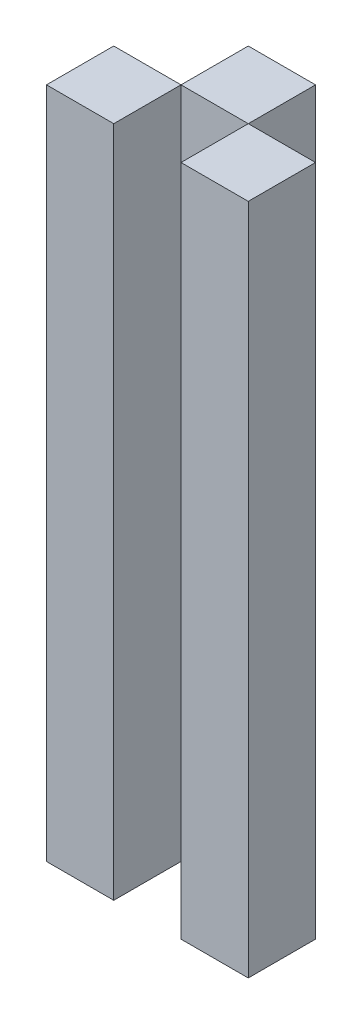
ISO-10303-21;
HEADER;
FILE_DESCRIPTION(('STEP AP214'),'2;1');
FILE_NAME('part.step','',(''),(''),'','','');
FILE_SCHEMA(('AUTOMOTIVE_DESIGN { 1 0 10303 214 1 1 1 1 }'));
ENDSEC;
DATA;
#1=APPLICATION_CONTEXT('core data for automotive mechanical design processes');
#2=APPLICATION_PROTOCOL_DEFINITION('international standard','automotive_design',2000,#1);
#3=PRODUCT_CONTEXT('',#1,'mechanical');
#4=PRODUCT('Part','Part','',(#3));
#5=PRODUCT_RELATED_PRODUCT_CATEGORY('part','',(#4));
#6=PRODUCT_DEFINITION_FORMATION('','',#4);
#7=PRODUCT_DEFINITION_CONTEXT('part definition',#1,'design');
#8=PRODUCT_DEFINITION('design','',#6,#7);
#9=PRODUCT_DEFINITION_SHAPE('','',#8);
#10=(LENGTH_UNIT() NAMED_UNIT(*) SI_UNIT(.MILLI.,.METRE.));
#11=(NAMED_UNIT(*) PLANE_ANGLE_UNIT() SI_UNIT($,.RADIAN.));
#12=(NAMED_UNIT(*) SI_UNIT($,.STERADIAN.) SOLID_ANGLE_UNIT());
#13=UNCERTAINTY_MEASURE_WITH_UNIT(LENGTH_MEASURE(1.E-05),#10,'distance_accuracy_value','');
#14=(GEOMETRIC_REPRESENTATION_CONTEXT(3) GLOBAL_UNCERTAINTY_ASSIGNED_CONTEXT((#13)) GLOBAL_UNIT_ASSIGNED_CONTEXT((#10,
#11,#12)) REPRESENTATION_CONTEXT('',''));
#15=CARTESIAN_POINT('',(0.,0.,0.));
#16=DIRECTION('',(0.,0.,1.));
#17=DIRECTION('',(1.,0.,0.));
#18=AXIS2_PLACEMENT_3D('',#15,#16,#17);
#19=CARTESIAN_POINT('',(25.4047173550075,254.,-25.4));
#20=DIRECTION('',(1.,0.,0.));
#21=DIRECTION('',(0.,1.,0.));
#22=AXIS2_PLACEMENT_3D('',#19,#20,#21);
#23=PLANE('',#22);
#24=DIRECTION('',(0.,1.,0.));
#25=VECTOR('',#24,1.);
#26=CARTESIAN_POINT('',(25.4047173550075,254.,0.));
#27=LINE('',#26,#25);
#28=CARTESIAN_POINT('',(25.4047173550075,0.,0.));
#29=VERTEX_POINT('',#28);
#30=CARTESIAN_POINT('',(25.4047173550075,254.,0.));
#31=VERTEX_POINT('',#30);
#32=EDGE_CURVE('E113',#29,#31,#27,.T.);
#33=ORIENTED_EDGE('',*,*,#32,.T.);
#34=DIRECTION('',(0.,0.,1.));
#35=VECTOR('',#34,1.);
#36=CARTESIAN_POINT('',(25.4047173550075,254.,-25.4));
#37=LINE('',#36,#35);
#38=CARTESIAN_POINT('',(25.4047173550075,254.,-25.4));
#39=VERTEX_POINT('',#38);
#40=EDGE_CURVE('E12',#39,#31,#37,.T.);
#41=ORIENTED_EDGE('',*,*,#40,.F.);
#42=DIRECTION('',(0.,1.,0.));
#43=VECTOR('',#42,1.);
#44=CARTESIAN_POINT('',(25.4047173550075,254.,-25.4));
#45=LINE('',#44,#43);
#46=CARTESIAN_POINT('',(25.4047173550075,0.,-25.4));
#47=VERTEX_POINT('',#46);
#48=EDGE_CURVE('E101',#47,#39,#45,.T.);
#49=ORIENTED_EDGE('',*,*,#48,.F.);
#50=DIRECTION('',(0.,0.,1.));
#51=VECTOR('',#50,1.);
#52=CARTESIAN_POINT('',(25.4047173550075,0.,-25.4));
#53=LINE('',#52,#51);
#54=EDGE_CURVE('E109',#47,#29,#53,.T.);
#55=ORIENTED_EDGE('',*,*,#54,.T.);
#56=EDGE_LOOP('',(#33,#41,#49,#55));
#57=FACE_BOUND('',#56,.T.);
#58=ADVANCED_FACE('F50',(#57),#23,.F.);
#59=CARTESIAN_POINT('',(50.8047173550075,254.,-25.4));
#60=DIRECTION('',(0.,-1.,0.));
#61=DIRECTION('',(0.,0.,-1.));
#62=AXIS2_PLACEMENT_3D('',#59,#60,#61);
#63=PLANE('',#62);
#64=DIRECTION('',(1.,0.,0.));
#65=VECTOR('',#64,1.);
#66=CARTESIAN_POINT('',(50.8047173550075,254.,0.));
#67=LINE('',#66,#65);
#68=CARTESIAN_POINT('',(50.8047173550075,254.,0.));
#69=VERTEX_POINT('',#68);
#70=EDGE_CURVE('E105',#31,#69,#67,.T.);
#71=ORIENTED_EDGE('',*,*,#70,.T.);
#72=DIRECTION('',(0.,0.,1.));
#73=VECTOR('',#72,1.);
#74=CARTESIAN_POINT('',(50.8047173550075,254.,-25.4));
#75=LINE('',#74,#73);
#76=CARTESIAN_POINT('',(50.8047173550075,254.,-25.4));
#77=VERTEX_POINT('',#76);
#78=EDGE_CURVE('E58',#77,#69,#75,.T.);
#79=ORIENTED_EDGE('',*,*,#78,.F.);
#80=DIRECTION('',(1.,0.,0.));
#81=VECTOR('',#80,1.);
#82=CARTESIAN_POINT('',(50.8047173550075,254.,-25.4));
#83=LINE('',#82,#81);
#84=EDGE_CURVE('E96',#39,#77,#83,.T.);
#85=ORIENTED_EDGE('',*,*,#84,.F.);
#86=ORIENTED_EDGE('',*,*,#40,.T.);
#87=EDGE_LOOP('',(#71,#79,#85,#86));
#88=FACE_BOUND('',#87,.T.);
#89=ADVANCED_FACE('F104',(#88),#63,.F.);
#90=CARTESIAN_POINT('',(50.8047173550075,0.,-25.4));
#91=DIRECTION('',(-1.,0.,0.));
#92=DIRECTION('',(0.,0.,1.));
#93=AXIS2_PLACEMENT_3D('',#90,#91,#92);
#94=PLANE('',#93);
#95=DIRECTION('',(0.,-1.,0.));
#96=VECTOR('',#95,1.);
#97=CARTESIAN_POINT('',(50.8047173550075,0.,0.));
#98=LINE('',#97,#96);
#99=CARTESIAN_POINT('',(50.8047173550075,0.,0.));
#100=VERTEX_POINT('',#99);
#101=EDGE_CURVE('E83',#69,#100,#98,.T.);
#102=ORIENTED_EDGE('',*,*,#101,.T.);
#103=DIRECTION('',(0.,0.,1.));
#104=VECTOR('',#103,1.);
#105=CARTESIAN_POINT('',(50.8047173550075,0.,-25.4));
#106=LINE('',#105,#104);
#107=CARTESIAN_POINT('',(50.8047173550075,0.,-25.4));
#108=VERTEX_POINT('',#107);
#109=EDGE_CURVE('E106',#108,#100,#106,.T.);
#110=ORIENTED_EDGE('',*,*,#109,.F.);
#111=DIRECTION('',(0.,-1.,0.));
#112=VECTOR('',#111,1.);
#113=CARTESIAN_POINT('',(50.8047173550075,0.,-25.4));
#114=LINE('',#113,#112);
#115=EDGE_CURVE('E99',#77,#108,#114,.T.);
#116=ORIENTED_EDGE('',*,*,#115,.F.);
#117=ORIENTED_EDGE('',*,*,#78,.T.);
#118=EDGE_LOOP('',(#102,#110,#116,#117));
#119=FACE_BOUND('',#118,.T.);
#120=ADVANCED_FACE('F107',(#119),#94,.F.);
#121=CARTESIAN_POINT('',(25.4047173550075,0.,-25.4));
#122=DIRECTION('',(0.,1.,0.));
#123=DIRECTION('',(0.,0.,1.));
#124=AXIS2_PLACEMENT_3D('',#121,#122,#123);
#125=PLANE('',#124);
#126=DIRECTION('',(-1.,0.,0.));
#127=VECTOR('',#126,1.);
#128=CARTESIAN_POINT('',(25.4047173550075,0.,0.));
#129=LINE('',#128,#127);
#130=EDGE_CURVE('E89',#100,#29,#129,.T.);
#131=ORIENTED_EDGE('',*,*,#130,.T.);
#132=ORIENTED_EDGE('',*,*,#54,.F.);
#133=DIRECTION('',(-1.,0.,0.));
#134=VECTOR('',#133,1.);
#135=CARTESIAN_POINT('',(25.4047173550075,0.,-25.4));
#136=LINE('',#135,#134);
#137=EDGE_CURVE('E66',#108,#47,#136,.T.);
#138=ORIENTED_EDGE('',*,*,#137,.F.);
#139=ORIENTED_EDGE('',*,*,#109,.T.);
#140=EDGE_LOOP('',(#131,#132,#138,#139));
#141=FACE_BOUND('',#140,.T.);
#142=ADVANCED_FACE('F120',(#141),#125,.F.);
#143=CARTESIAN_POINT('',(0.,0.,-25.4));
#144=DIRECTION('',(0.,0.,1.));
#145=DIRECTION('',(1.,0.,0.));
#146=AXIS2_PLACEMENT_3D('',#143,#144,#145);
#147=PLANE('',#146);
#148=ORIENTED_EDGE('',*,*,#48,.T.);
#149=ORIENTED_EDGE('',*,*,#84,.T.);
#150=ORIENTED_EDGE('',*,*,#115,.T.);
#151=ORIENTED_EDGE('',*,*,#137,.T.);
#152=EDGE_LOOP('',(#148,#149,#150,#151));
#153=FACE_BOUND('',#152,.T.);
#154=ADVANCED_FACE('F97',(#153),#147,.F.);
#155=CARTESIAN_POINT('',(0.,0.,0.));
#156=DIRECTION('',(0.,0.,1.));
#157=DIRECTION('',(1.,0.,0.));
#158=AXIS2_PLACEMENT_3D('',#155,#156,#157);
#159=PLANE('',#158);
#160=ORIENTED_EDGE('',*,*,#32,.F.);
#161=ORIENTED_EDGE('',*,*,#130,.F.);
#162=ORIENTED_EDGE('',*,*,#101,.F.);
#163=ORIENTED_EDGE('',*,*,#70,.F.);
#164=EDGE_LOOP('',(#160,#161,#162,#163));
#165=FACE_BOUND('',#164,.T.);
#166=ADVANCED_FACE('F123',(#165),#159,.T.);
#167=CLOSED_SHELL('',(#58,#89,#120,#142,#154,#166));
#168=MANIFOLD_SOLID_BREP('B2',#167);
#169=CARTESIAN_POINT('',(0.,254.,25.4));
#170=DIRECTION('',(0.,-1.,0.));
#171=DIRECTION('',(0.,0.,-1.));
#172=AXIS2_PLACEMENT_3D('',#169,#170,#171);
#173=PLANE('',#172);
#174=DIRECTION('',(-1.,0.,0.));
#175=VECTOR('',#174,1.);
#176=CARTESIAN_POINT('',(0.,254.,0.));
#177=LINE('',#176,#175);
#178=CARTESIAN_POINT('',(25.4047173550075,254.,0.));
#179=VERTEX_POINT('',#178);
#180=CARTESIAN_POINT('',(0.,254.,0.));
#181=VERTEX_POINT('',#180);
#182=EDGE_CURVE('E246',#179,#181,#177,.T.);
#183=ORIENTED_EDGE('',*,*,#182,.T.);
#184=DIRECTION('',(0.,0.,-1.));
#185=VECTOR('',#184,1.);
#186=CARTESIAN_POINT('',(0.,254.,25.4));
#187=LINE('',#186,#185);
#188=CARTESIAN_POINT('',(0.,254.,25.4));
#189=VERTEX_POINT('',#188);
#190=EDGE_CURVE('E48',#189,#181,#187,.T.);
#191=ORIENTED_EDGE('',*,*,#190,.F.);
#192=DIRECTION('',(-1.,0.,0.));
#193=VECTOR('',#192,1.);
#194=CARTESIAN_POINT('',(0.,254.,25.4));
#195=LINE('',#194,#193);
#196=CARTESIAN_POINT('',(25.4047173550075,254.,25.4));
#197=VERTEX_POINT('',#196);
#198=EDGE_CURVE('E234',#197,#189,#195,.T.);
#199=ORIENTED_EDGE('',*,*,#198,.F.);
#200=DIRECTION('',(0.,0.,-1.));
#201=VECTOR('',#200,1.);
#202=CARTESIAN_POINT('',(25.4047173550075,254.,25.4));
#203=LINE('',#202,#201);
#204=EDGE_CURVE('E242',#197,#179,#203,.T.);
#205=ORIENTED_EDGE('',*,*,#204,.T.);
#206=EDGE_LOOP('',(#183,#191,#199,#205));
#207=FACE_BOUND('',#206,.T.);
#208=ADVANCED_FACE('F183',(#207),#173,.F.);
#209=CARTESIAN_POINT('',(0.,0.,25.4));
#210=DIRECTION('',(1.,0.,0.));
#211=DIRECTION('',(0.,0.,-1.));
#212=AXIS2_PLACEMENT_3D('',#209,#210,#211);
#213=PLANE('',#212);
#214=DIRECTION('',(0.,-1.,0.));
#215=VECTOR('',#214,1.);
#216=CARTESIAN_POINT('',(0.,0.,0.));
#217=LINE('',#216,#215);
#218=CARTESIAN_POINT('',(0.,0.,0.));
#219=VERTEX_POINT('',#218);
#220=EDGE_CURVE('E238',#181,#219,#217,.T.);
#221=ORIENTED_EDGE('',*,*,#220,.T.);
#222=DIRECTION('',(0.,0.,-1.));
#223=VECTOR('',#222,1.);
#224=CARTESIAN_POINT('',(0.,0.,25.4));
#225=LINE('',#224,#223);
#226=CARTESIAN_POINT('',(0.,0.,25.4));
#227=VERTEX_POINT('',#226);
#228=EDGE_CURVE('E191',#227,#219,#225,.T.);
#229=ORIENTED_EDGE('',*,*,#228,.F.);
#230=DIRECTION('',(0.,-1.,0.));
#231=VECTOR('',#230,1.);
#232=CARTESIAN_POINT('',(0.,0.,25.4));
#233=LINE('',#232,#231);
#234=EDGE_CURVE('E229',#189,#227,#233,.T.);
#235=ORIENTED_EDGE('',*,*,#234,.F.);
#236=ORIENTED_EDGE('',*,*,#190,.T.);
#237=EDGE_LOOP('',(#221,#229,#235,#236));
#238=FACE_BOUND('',#237,.T.);
#239=ADVANCED_FACE('F237',(#238),#213,.F.);
#240=CARTESIAN_POINT('',(0.,0.,25.4));
#241=DIRECTION('',(0.,1.,0.));
#242=DIRECTION('',(0.,0.,1.));
#243=AXIS2_PLACEMENT_3D('',#240,#241,#242);
#244=PLANE('',#243);
#245=DIRECTION('',(1.,0.,0.));
#246=VECTOR('',#245,1.);
#247=CARTESIAN_POINT('',(0.,0.,0.));
#248=LINE('',#247,#246);
#249=CARTESIAN_POINT('',(25.4047173550075,0.,0.));
#250=VERTEX_POINT('',#249);
#251=EDGE_CURVE('E216',#219,#250,#248,.T.);
#252=ORIENTED_EDGE('',*,*,#251,.T.);
#253=DIRECTION('',(0.,0.,-1.));
#254=VECTOR('',#253,1.);
#255=CARTESIAN_POINT('',(25.4047173550075,0.,25.4));
#256=LINE('',#255,#254);
#257=CARTESIAN_POINT('',(25.4047173550075,0.,25.4));
#258=VERTEX_POINT('',#257);
#259=EDGE_CURVE('E239',#258,#250,#256,.T.);
#260=ORIENTED_EDGE('',*,*,#259,.F.);
#261=DIRECTION('',(1.,0.,0.));
#262=VECTOR('',#261,1.);
#263=CARTESIAN_POINT('',(0.,0.,25.4));
#264=LINE('',#263,#262);
#265=EDGE_CURVE('E232',#227,#258,#264,.T.);
#266=ORIENTED_EDGE('',*,*,#265,.F.);
#267=ORIENTED_EDGE('',*,*,#228,.T.);
#268=EDGE_LOOP('',(#252,#260,#266,#267));
#269=FACE_BOUND('',#268,.T.);
#270=ADVANCED_FACE('F240',(#269),#244,.F.);
#271=CARTESIAN_POINT('',(25.4047173550075,0.,25.4));
#272=DIRECTION('',(-1.,0.,0.));
#273=DIRECTION('',(0.,0.,1.));
#274=AXIS2_PLACEMENT_3D('',#271,#272,#273);
#275=PLANE('',#274);
#276=DIRECTION('',(0.,1.,0.));
#277=VECTOR('',#276,1.);
#278=CARTESIAN_POINT('',(25.4047173550075,0.,0.));
#279=LINE('',#278,#277);
#280=EDGE_CURVE('E222',#250,#179,#279,.T.);
#281=ORIENTED_EDGE('',*,*,#280,.T.);
#282=ORIENTED_EDGE('',*,*,#204,.F.);
#283=DIRECTION('',(0.,1.,0.));
#284=VECTOR('',#283,1.);
#285=CARTESIAN_POINT('',(25.4047173550075,0.,25.4));
#286=LINE('',#285,#284);
#287=EDGE_CURVE('E199',#258,#197,#286,.T.);
#288=ORIENTED_EDGE('',*,*,#287,.F.);
#289=ORIENTED_EDGE('',*,*,#259,.T.);
#290=EDGE_LOOP('',(#281,#282,#288,#289));
#291=FACE_BOUND('',#290,.T.);
#292=ADVANCED_FACE('F253',(#291),#275,.F.);
#293=CARTESIAN_POINT('',(0.,0.,25.4));
#294=DIRECTION('',(0.,0.,1.));
#295=DIRECTION('',(1.,0.,0.));
#296=AXIS2_PLACEMENT_3D('',#293,#294,#295);
#297=PLANE('',#296);
#298=ORIENTED_EDGE('',*,*,#198,.T.);
#299=ORIENTED_EDGE('',*,*,#234,.T.);
#300=ORIENTED_EDGE('',*,*,#265,.T.);
#301=ORIENTED_EDGE('',*,*,#287,.T.);
#302=EDGE_LOOP('',(#298,#299,#300,#301));
#303=FACE_BOUND('',#302,.T.);
#304=ADVANCED_FACE('F230',(#303),#297,.T.);
#305=CARTESIAN_POINT('',(0.,0.,0.));
#306=DIRECTION('',(0.,0.,1.));
#307=DIRECTION('',(1.,0.,0.));
#308=AXIS2_PLACEMENT_3D('',#305,#306,#307);
#309=PLANE('',#308);
#310=ORIENTED_EDGE('',*,*,#182,.F.);
#311=ORIENTED_EDGE('',*,*,#280,.F.);
#312=ORIENTED_EDGE('',*,*,#251,.F.);
#313=ORIENTED_EDGE('',*,*,#220,.F.);
#314=EDGE_LOOP('',(#310,#311,#312,#313));
#315=FACE_BOUND('',#314,.T.);
#316=ADVANCED_FACE('F256',(#315),#309,.F.);
#317=CLOSED_SHELL('',(#208,#239,#270,#292,#304,#316));
#318=MANIFOLD_SOLID_BREP('B6',#317);
#319=CARTESIAN_POINT('',(0.,0.,25.4));
#320=DIRECTION('',(0.,1.,0.));
#321=DIRECTION('',(0.,0.,1.));
#322=AXIS2_PLACEMENT_3D('',#319,#320,#321);
#323=PLANE('',#322);
#324=DIRECTION('',(1.,0.,0.));
#325=VECTOR('',#324,1.);
#326=CARTESIAN_POINT('',(0.,0.,0.));
#327=LINE('',#326,#325);
#328=CARTESIAN_POINT('',(50.8047173550075,0.,0.));
#329=VERTEX_POINT('',#328);
#330=CARTESIAN_POINT('',(76.2,0.,0.));
#331=VERTEX_POINT('',#330);
#332=EDGE_CURVE('E372',#329,#331,#327,.T.);
#333=ORIENTED_EDGE('',*,*,#332,.T.);
#334=DIRECTION('',(0.,0.,-1.));
#335=VECTOR('',#334,1.);
#336=CARTESIAN_POINT('',(76.2,0.,25.4));
#337=LINE('',#336,#335);
#338=CARTESIAN_POINT('',(76.2,0.,25.4));
#339=VERTEX_POINT('',#338);
#340=EDGE_CURVE('E181',#339,#331,#337,.T.);
#341=ORIENTED_EDGE('',*,*,#340,.F.);
#342=DIRECTION('',(1.,0.,0.));
#343=VECTOR('',#342,1.);
#344=CARTESIAN_POINT('',(0.,0.,25.4));
#345=LINE('',#344,#343);
#346=CARTESIAN_POINT('',(50.8047173550075,0.,25.4));
#347=VERTEX_POINT('',#346);
#348=EDGE_CURVE('E360',#347,#339,#345,.T.);
#349=ORIENTED_EDGE('',*,*,#348,.F.);
#350=DIRECTION('',(0.,0.,-1.));
#351=VECTOR('',#350,1.);
#352=CARTESIAN_POINT('',(50.8047173550075,0.,25.4));
#353=LINE('',#352,#351);
#354=EDGE_CURVE('E368',#347,#329,#353,.T.);
#355=ORIENTED_EDGE('',*,*,#354,.T.);
#356=EDGE_LOOP('',(#333,#341,#349,#355));
#357=FACE_BOUND('',#356,.T.);
#358=ADVANCED_FACE('F309',(#357),#323,.F.);
#359=CARTESIAN_POINT('',(76.2,0.,25.4));
#360=DIRECTION('',(-1.,0.,0.));
#361=DIRECTION('',(0.,0.,1.));
#362=AXIS2_PLACEMENT_3D('',#359,#360,#361);
#363=PLANE('',#362);
#364=DIRECTION('',(0.,1.,0.));
#365=VECTOR('',#364,1.);
#366=CARTESIAN_POINT('',(76.2,0.,0.));
#367=LINE('',#366,#365);
#368=CARTESIAN_POINT('',(76.2,254.,0.));
#369=VERTEX_POINT('',#368);
#370=EDGE_CURVE('E364',#331,#369,#367,.T.);
#371=ORIENTED_EDGE('',*,*,#370,.T.);
#372=DIRECTION('',(0.,0.,-1.));
#373=VECTOR('',#372,1.);
#374=CARTESIAN_POINT('',(76.2,254.,25.4));
#375=LINE('',#374,#373);
#376=CARTESIAN_POINT('',(76.2,254.,25.4));
#377=VERTEX_POINT('',#376);
#378=EDGE_CURVE('E317',#377,#369,#375,.T.);
#379=ORIENTED_EDGE('',*,*,#378,.F.);
#380=DIRECTION('',(0.,1.,0.));
#381=VECTOR('',#380,1.);
#382=CARTESIAN_POINT('',(76.2,0.,25.4));
#383=LINE('',#382,#381);
#384=EDGE_CURVE('E355',#339,#377,#383,.T.);
#385=ORIENTED_EDGE('',*,*,#384,.F.);
#386=ORIENTED_EDGE('',*,*,#340,.T.);
#387=EDGE_LOOP('',(#371,#379,#385,#386));
#388=FACE_BOUND('',#387,.T.);
#389=ADVANCED_FACE('F363',(#388),#363,.F.);
#390=CARTESIAN_POINT('',(0.,254.,25.4));
#391=DIRECTION('',(0.,-1.,0.));
#392=DIRECTION('',(0.,0.,-1.));
#393=AXIS2_PLACEMENT_3D('',#390,#391,#392);
#394=PLANE('',#393);
#395=DIRECTION('',(-1.,0.,0.));
#396=VECTOR('',#395,1.);
#397=CARTESIAN_POINT('',(0.,254.,0.));
#398=LINE('',#397,#396);
#399=CARTESIAN_POINT('',(50.8047173550075,254.,0.));
#400=VERTEX_POINT('',#399);
#401=EDGE_CURVE('E342',#369,#400,#398,.T.);
#402=ORIENTED_EDGE('',*,*,#401,.T.);
#403=DIRECTION('',(0.,0.,-1.));
#404=VECTOR('',#403,1.);
#405=CARTESIAN_POINT('',(50.8047173550075,254.,25.4));
#406=LINE('',#405,#404);
#407=CARTESIAN_POINT('',(50.8047173550075,254.,25.4));
#408=VERTEX_POINT('',#407);
#409=EDGE_CURVE('E365',#408,#400,#406,.T.);
#410=ORIENTED_EDGE('',*,*,#409,.F.);
#411=DIRECTION('',(-1.,0.,0.));
#412=VECTOR('',#411,1.);
#413=CARTESIAN_POINT('',(0.,254.,25.4));
#414=LINE('',#413,#412);
#415=EDGE_CURVE('E358',#377,#408,#414,.T.);
#416=ORIENTED_EDGE('',*,*,#415,.F.);
#417=ORIENTED_EDGE('',*,*,#378,.T.);
#418=EDGE_LOOP('',(#402,#410,#416,#417));
#419=FACE_BOUND('',#418,.T.);
#420=ADVANCED_FACE('F366',(#419),#394,.F.);
#421=CARTESIAN_POINT('',(50.8047173550075,0.,25.4));
#422=DIRECTION('',(1.,0.,0.));
#423=DIRECTION('',(0.,0.,-1.));
#424=AXIS2_PLACEMENT_3D('',#421,#422,#423);
#425=PLANE('',#424);
#426=DIRECTION('',(0.,-1.,0.));
#427=VECTOR('',#426,1.);
#428=CARTESIAN_POINT('',(50.8047173550075,0.,0.));
#429=LINE('',#428,#427);
#430=EDGE_CURVE('E348',#400,#329,#429,.T.);
#431=ORIENTED_EDGE('',*,*,#430,.T.);
#432=ORIENTED_EDGE('',*,*,#354,.F.);
#433=DIRECTION('',(0.,-1.,0.));
#434=VECTOR('',#433,1.);
#435=CARTESIAN_POINT('',(50.8047173550075,0.,25.4));
#436=LINE('',#435,#434);
#437=EDGE_CURVE('E325',#408,#347,#436,.T.);
#438=ORIENTED_EDGE('',*,*,#437,.F.);
#439=ORIENTED_EDGE('',*,*,#409,.T.);
#440=EDGE_LOOP('',(#431,#432,#438,#439));
#441=FACE_BOUND('',#440,.T.);
#442=ADVANCED_FACE('F379',(#441),#425,.F.);
#443=CARTESIAN_POINT('',(0.,0.,25.4));
#444=DIRECTION('',(0.,0.,1.));
#445=DIRECTION('',(1.,0.,0.));
#446=AXIS2_PLACEMENT_3D('',#443,#444,#445);
#447=PLANE('',#446);
#448=ORIENTED_EDGE('',*,*,#348,.T.);
#449=ORIENTED_EDGE('',*,*,#384,.T.);
#450=ORIENTED_EDGE('',*,*,#415,.T.);
#451=ORIENTED_EDGE('',*,*,#437,.T.);
#452=EDGE_LOOP('',(#448,#449,#450,#451));
#453=FACE_BOUND('',#452,.T.);
#454=ADVANCED_FACE('F356',(#453),#447,.T.);
#455=CARTESIAN_POINT('',(0.,0.,0.));
#456=DIRECTION('',(0.,0.,1.));
#457=DIRECTION('',(1.,0.,0.));
#458=AXIS2_PLACEMENT_3D('',#455,#456,#457);
#459=PLANE('',#458);
#460=ORIENTED_EDGE('',*,*,#332,.F.);
#461=ORIENTED_EDGE('',*,*,#430,.F.);
#462=ORIENTED_EDGE('',*,*,#401,.F.);
#463=ORIENTED_EDGE('',*,*,#370,.F.);
#464=EDGE_LOOP('',(#460,#461,#462,#463));
#465=FACE_BOUND('',#464,.T.);
#466=ADVANCED_FACE('F382',(#465),#459,.F.);
#467=CLOSED_SHELL('',(#358,#389,#420,#442,#454,#466));
#468=MANIFOLD_SOLID_BREP('B42',#467);
#469=ADVANCED_BREP_SHAPE_REPRESENTATION('',(#18,#168,#318,#468),#14);
#470=SHAPE_DEFINITION_REPRESENTATION(#9,#469);
ENDSEC;
END-ISO-10303-21;
